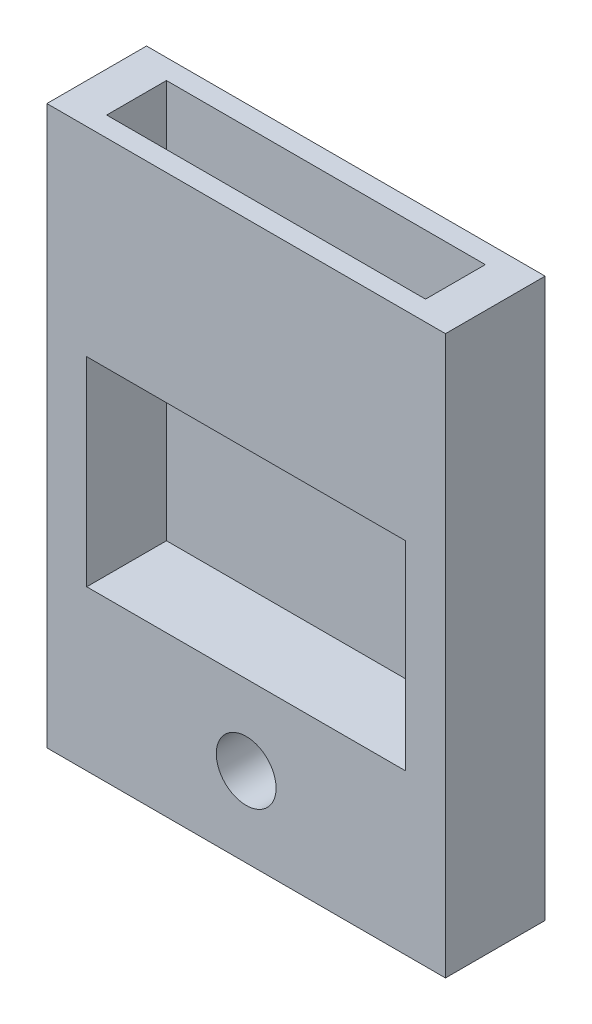
ISO-10303-21;
HEADER;
FILE_DESCRIPTION(('STEP AP214'),'2;1');
FILE_NAME('part.step','',(''),(''),'','','');
FILE_SCHEMA(('AUTOMOTIVE_DESIGN { 1 0 10303 214 1 1 1 1 }'));
ENDSEC;
DATA;
#1=APPLICATION_CONTEXT('core data for automotive mechanical design processes');
#2=APPLICATION_PROTOCOL_DEFINITION('international standard','automotive_design',2000,#1);
#3=PRODUCT_CONTEXT('',#1,'mechanical');
#4=PRODUCT('Part','Part','',(#3));
#5=PRODUCT_RELATED_PRODUCT_CATEGORY('part','',(#4));
#6=PRODUCT_DEFINITION_FORMATION('','',#4);
#7=PRODUCT_DEFINITION_CONTEXT('part definition',#1,'design');
#8=PRODUCT_DEFINITION('design','',#6,#7);
#9=PRODUCT_DEFINITION_SHAPE('','',#8);
#10=(LENGTH_UNIT() NAMED_UNIT(*) SI_UNIT(.MILLI.,.METRE.));
#11=(NAMED_UNIT(*) PLANE_ANGLE_UNIT() SI_UNIT($,.RADIAN.));
#12=(NAMED_UNIT(*) SI_UNIT($,.STERADIAN.) SOLID_ANGLE_UNIT());
#13=UNCERTAINTY_MEASURE_WITH_UNIT(LENGTH_MEASURE(1.E-05),#10,'distance_accuracy_value','');
#14=(GEOMETRIC_REPRESENTATION_CONTEXT(3) GLOBAL_UNCERTAINTY_ASSIGNED_CONTEXT((#13)) GLOBAL_UNIT_ASSIGNED_CONTEXT((#10,
#11,#12)) REPRESENTATION_CONTEXT('',''));
#15=CARTESIAN_POINT('',(0.,0.,0.));
#16=DIRECTION('',(0.,0.,1.));
#17=DIRECTION('',(1.,0.,0.));
#18=AXIS2_PLACEMENT_3D('',#15,#16,#17);
#19=CARTESIAN_POINT('',(0.,0.,5.));
#20=DIRECTION('',(1.,0.,0.));
#21=DIRECTION('',(0.,0.,-1.));
#22=AXIS2_PLACEMENT_3D('',#19,#20,#21);
#23=PLANE('',#22);
#24=DIRECTION('',(0.,-1.,0.));
#25=VECTOR('',#24,1.);
#26=CARTESIAN_POINT('',(0.,0.,0.));
#27=LINE('',#26,#25);
#28=CARTESIAN_POINT('',(0.,28.,0.));
#29=VERTEX_POINT('',#28);
#30=CARTESIAN_POINT('',(0.,0.,0.));
#31=VERTEX_POINT('',#30);
#32=EDGE_CURVE('E165',#29,#31,#27,.T.);
#33=ORIENTED_EDGE('',*,*,#32,.T.);
#34=DIRECTION('',(0.,0.,-1.));
#35=VECTOR('',#34,1.);
#36=CARTESIAN_POINT('',(0.,0.,5.));
#37=LINE('',#36,#35);
#38=CARTESIAN_POINT('',(0.,0.,5.));
#39=VERTEX_POINT('',#38);
#40=EDGE_CURVE('E11',#39,#31,#37,.T.);
#41=ORIENTED_EDGE('',*,*,#40,.F.);
#42=DIRECTION('',(0.,-1.,0.));
#43=VECTOR('',#42,1.);
#44=CARTESIAN_POINT('',(0.,0.,5.));
#45=LINE('',#44,#43);
#46=CARTESIAN_POINT('',(0.,28.,5.));
#47=VERTEX_POINT('',#46);
#48=EDGE_CURVE('E168',#47,#39,#45,.T.);
#49=ORIENTED_EDGE('',*,*,#48,.F.);
#50=DIRECTION('',(0.,0.,-1.));
#51=VECTOR('',#50,1.);
#52=CARTESIAN_POINT('',(0.,28.,5.));
#53=LINE('',#52,#51);
#54=EDGE_CURVE('E178',#47,#29,#53,.T.);
#55=ORIENTED_EDGE('',*,*,#54,.T.);
#56=EDGE_LOOP('',(#33,#41,#49,#55));
#57=FACE_BOUND('',#56,.T.);
#58=ADVANCED_FACE('F33',(#57),#23,.F.);
#59=CARTESIAN_POINT('',(0.,0.,5.));
#60=DIRECTION('',(0.,1.,0.));
#61=DIRECTION('',(0.,0.,1.));
#62=AXIS2_PLACEMENT_3D('',#59,#60,#61);
#63=PLANE('',#62);
#64=DIRECTION('',(1.,0.,0.));
#65=VECTOR('',#64,1.);
#66=CARTESIAN_POINT('',(0.,0.,0.));
#67=LINE('',#66,#65);
#68=CARTESIAN_POINT('',(20.,0.,0.));
#69=VERTEX_POINT('',#68);
#70=EDGE_CURVE('E181',#31,#69,#67,.T.);
#71=ORIENTED_EDGE('',*,*,#70,.T.);
#72=DIRECTION('',(0.,0.,-1.));
#73=VECTOR('',#72,1.);
#74=CARTESIAN_POINT('',(20.,0.,5.));
#75=LINE('',#74,#73);
#76=CARTESIAN_POINT('',(20.,0.,5.));
#77=VERTEX_POINT('',#76);
#78=EDGE_CURVE('E40',#77,#69,#75,.T.);
#79=ORIENTED_EDGE('',*,*,#78,.F.);
#80=DIRECTION('',(1.,0.,0.));
#81=VECTOR('',#80,1.);
#82=CARTESIAN_POINT('',(0.,0.,5.));
#83=LINE('',#82,#81);
#84=EDGE_CURVE('E171',#39,#77,#83,.T.);
#85=ORIENTED_EDGE('',*,*,#84,.F.);
#86=ORIENTED_EDGE('',*,*,#40,.T.);
#87=EDGE_LOOP('',(#71,#79,#85,#86));
#88=FACE_BOUND('',#87,.T.);
#89=ADVANCED_FACE('F210',(#88),#63,.F.);
#90=CARTESIAN_POINT('',(20.,0.,5.));
#91=DIRECTION('',(-1.,0.,0.));
#92=DIRECTION('',(0.,0.,1.));
#93=AXIS2_PLACEMENT_3D('',#90,#91,#92);
#94=PLANE('',#93);
#95=DIRECTION('',(0.,1.,0.));
#96=VECTOR('',#95,1.);
#97=CARTESIAN_POINT('',(20.,0.,0.));
#98=LINE('',#97,#96);
#99=CARTESIAN_POINT('',(20.,28.,0.));
#100=VERTEX_POINT('',#99);
#101=EDGE_CURVE('E183',#69,#100,#98,.T.);
#102=ORIENTED_EDGE('',*,*,#101,.T.);
#103=DIRECTION('',(0.,0.,-1.));
#104=VECTOR('',#103,1.);
#105=CARTESIAN_POINT('',(20.,28.,5.));
#106=LINE('',#105,#104);
#107=CARTESIAN_POINT('',(20.,28.,5.));
#108=VERTEX_POINT('',#107);
#109=EDGE_CURVE('E188',#108,#100,#106,.T.);
#110=ORIENTED_EDGE('',*,*,#109,.F.);
#111=DIRECTION('',(0.,1.,0.));
#112=VECTOR('',#111,1.);
#113=CARTESIAN_POINT('',(20.,0.,5.));
#114=LINE('',#113,#112);
#115=EDGE_CURVE('E174',#77,#108,#114,.T.);
#116=ORIENTED_EDGE('',*,*,#115,.F.);
#117=ORIENTED_EDGE('',*,*,#78,.T.);
#118=EDGE_LOOP('',(#102,#110,#116,#117));
#119=FACE_BOUND('',#118,.T.);
#120=ADVANCED_FACE('F195',(#119),#94,.F.);
#121=CARTESIAN_POINT('',(0.,28.,5.));
#122=DIRECTION('',(0.,-1.,0.));
#123=DIRECTION('',(0.,0.,-1.));
#124=AXIS2_PLACEMENT_3D('',#121,#122,#123);
#125=PLANE('',#124);
#126=DIRECTION('',(-1.,0.,0.));
#127=VECTOR('',#126,1.);
#128=CARTESIAN_POINT('',(2.,28.,0.999999999999997));
#129=LINE('',#128,#127);
#130=CARTESIAN_POINT('',(18.,28.,0.999999999999997));
#131=VERTEX_POINT('',#130);
#132=CARTESIAN_POINT('',(2.,28.,0.999999999999997));
#133=VERTEX_POINT('',#132);
#134=EDGE_CURVE('E147',#131,#133,#129,.T.);
#135=ORIENTED_EDGE('',*,*,#134,.F.);
#136=DIRECTION('',(0.,0.,-1.));
#137=VECTOR('',#136,1.);
#138=CARTESIAN_POINT('',(18.,28.,4.));
#139=LINE('',#138,#137);
#140=CARTESIAN_POINT('',(18.,28.,4.));
#141=VERTEX_POINT('',#140);
#142=EDGE_CURVE('E142',#141,#131,#139,.T.);
#143=ORIENTED_EDGE('',*,*,#142,.F.);
#144=DIRECTION('',(1.,0.,0.));
#145=VECTOR('',#144,1.);
#146=CARTESIAN_POINT('',(2.,28.,4.));
#147=LINE('',#146,#145);
#148=CARTESIAN_POINT('',(2.,28.,4.));
#149=VERTEX_POINT('',#148);
#150=EDGE_CURVE('E119',#149,#141,#147,.T.);
#151=ORIENTED_EDGE('',*,*,#150,.F.);
#152=DIRECTION('',(0.,0.,1.));
#153=VECTOR('',#152,1.);
#154=CARTESIAN_POINT('',(2.,28.,4.));
#155=LINE('',#154,#153);
#156=EDGE_CURVE('E149',#133,#149,#155,.T.);
#157=ORIENTED_EDGE('',*,*,#156,.F.);
#158=EDGE_LOOP('',(#135,#143,#151,#157));
#159=FACE_BOUND('',#158,.T.);
#160=DIRECTION('',(-1.,0.,0.));
#161=VECTOR('',#160,1.);
#162=CARTESIAN_POINT('',(0.,28.,0.));
#163=LINE('',#162,#161);
#164=EDGE_CURVE('E172',#100,#29,#163,.T.);
#165=ORIENTED_EDGE('',*,*,#164,.T.);
#166=ORIENTED_EDGE('',*,*,#54,.F.);
#167=DIRECTION('',(-1.,0.,0.));
#168=VECTOR('',#167,1.);
#169=CARTESIAN_POINT('',(0.,28.,5.));
#170=LINE('',#169,#168);
#171=EDGE_CURVE('E176',#108,#47,#170,.T.);
#172=ORIENTED_EDGE('',*,*,#171,.F.);
#173=ORIENTED_EDGE('',*,*,#109,.T.);
#174=EDGE_LOOP('',(#165,#166,#172,#173));
#175=FACE_BOUND('',#174,.T.);
#176=ADVANCED_FACE('F204',(#159,#175),#125,.F.);
#177=CARTESIAN_POINT('',(0.,0.,5.));
#178=DIRECTION('',(0.,0.,-1.));
#179=DIRECTION('',(-1.,0.,0.));
#180=AXIS2_PLACEMENT_3D('',#177,#178,#179);
#181=PLANE('',#180);
#182=DIRECTION('',(1.,0.,0.));
#183=VECTOR('',#182,1.);
#184=CARTESIAN_POINT('',(2.,8.,5.));
#185=LINE('',#184,#183);
#186=CARTESIAN_POINT('',(2.,8.,5.));
#187=VERTEX_POINT('',#186);
#188=CARTESIAN_POINT('',(18.,8.,5.));
#189=VERTEX_POINT('',#188);
#190=EDGE_CURVE('E122',#187,#189,#185,.T.);
#191=ORIENTED_EDGE('',*,*,#190,.F.);
#192=DIRECTION('',(0.,-1.,0.));
#193=VECTOR('',#192,1.);
#194=CARTESIAN_POINT('',(2.,18.,5.));
#195=LINE('',#194,#193);
#196=CARTESIAN_POINT('',(2.,18.,5.));
#197=VERTEX_POINT('',#196);
#198=EDGE_CURVE('E126',#197,#187,#195,.T.);
#199=ORIENTED_EDGE('',*,*,#198,.F.);
#200=DIRECTION('',(-1.,0.,0.));
#201=VECTOR('',#200,1.);
#202=CARTESIAN_POINT('',(2.,18.,5.));
#203=LINE('',#202,#201);
#204=CARTESIAN_POINT('',(18.,18.,5.));
#205=VERTEX_POINT('',#204);
#206=EDGE_CURVE('E131',#205,#197,#203,.T.);
#207=ORIENTED_EDGE('',*,*,#206,.F.);
#208=DIRECTION('',(0.,1.,0.));
#209=VECTOR('',#208,1.);
#210=CARTESIAN_POINT('',(18.,18.,5.));
#211=LINE('',#210,#209);
#212=EDGE_CURVE('E116',#189,#205,#211,.T.);
#213=ORIENTED_EDGE('',*,*,#212,.F.);
#214=EDGE_LOOP('',(#191,#199,#207,#213));
#215=FACE_BOUND('',#214,.T.);
#216=CARTESIAN_POINT('',(10.,4.,5.));
#217=DIRECTION('',(0.,0.,1.));
#218=DIRECTION('',(1.,0.,0.));
#219=AXIS2_PLACEMENT_3D('',#216,#217,#218);
#220=CIRCLE('',#219,1.5);
#221=CARTESIAN_POINT('',(11.5,4.,5.));
#222=VERTEX_POINT('',#221);
#223=EDGE_CURVE('E156',#222,#222,#220,.T.);
#224=ORIENTED_EDGE('',*,*,#223,.F.);
#225=EDGE_LOOP('',(#224));
#226=FACE_BOUND('',#225,.T.);
#227=ORIENTED_EDGE('',*,*,#48,.T.);
#228=ORIENTED_EDGE('',*,*,#84,.T.);
#229=ORIENTED_EDGE('',*,*,#115,.T.);
#230=ORIENTED_EDGE('',*,*,#171,.T.);
#231=EDGE_LOOP('',(#227,#228,#229,#230));
#232=FACE_BOUND('',#231,.T.);
#233=ADVANCED_FACE('F128',(#215,#226,#232),#181,.F.);
#234=CARTESIAN_POINT('',(0.,0.,0.));
#235=DIRECTION('',(0.,0.,-1.));
#236=DIRECTION('',(-1.,0.,0.));
#237=AXIS2_PLACEMENT_3D('',#234,#235,#236);
#238=PLANE('',#237);
#239=CARTESIAN_POINT('',(10.,4.,0.));
#240=DIRECTION('',(0.,0.,1.));
#241=DIRECTION('',(1.,0.,0.));
#242=AXIS2_PLACEMENT_3D('',#239,#240,#241);
#243=CIRCLE('',#242,1.5);
#244=CARTESIAN_POINT('',(11.5,4.,0.));
#245=VERTEX_POINT('',#244);
#246=EDGE_CURVE('E162',#245,#245,#243,.T.);
#247=ORIENTED_EDGE('',*,*,#246,.T.);
#248=EDGE_LOOP('',(#247));
#249=FACE_BOUND('',#248,.T.);
#250=ORIENTED_EDGE('',*,*,#32,.F.);
#251=ORIENTED_EDGE('',*,*,#164,.F.);
#252=ORIENTED_EDGE('',*,*,#101,.F.);
#253=ORIENTED_EDGE('',*,*,#70,.F.);
#254=EDGE_LOOP('',(#250,#251,#252,#253));
#255=FACE_BOUND('',#254,.T.);
#256=ADVANCED_FACE('F201',(#249,#255),#238,.T.);
#257=CARTESIAN_POINT('',(10.,4.,0.));
#258=DIRECTION('',(0.,0.,1.));
#259=DIRECTION('',(1.,0.,0.));
#260=AXIS2_PLACEMENT_3D('',#257,#258,#259);
#261=CYLINDRICAL_SURFACE('',#260,1.5);
#262=ORIENTED_EDGE('',*,*,#246,.F.);
#263=EDGE_LOOP('',(#262));
#264=FACE_BOUND('',#263,.T.);
#265=ORIENTED_EDGE('',*,*,#223,.T.);
#266=EDGE_LOOP('',(#265));
#267=FACE_BOUND('',#266,.T.);
#268=ADVANCED_FACE('F223',(#264,#267),#261,.F.);
#269=CARTESIAN_POINT('',(18.,8.,4.));
#270=DIRECTION('',(1.,0.,0.));
#271=DIRECTION('',(0.,0.,-1.));
#272=AXIS2_PLACEMENT_3D('',#269,#270,#271);
#273=PLANE('',#272);
#274=ORIENTED_EDGE('',*,*,#142,.T.);
#275=DIRECTION('',(0.,1.,0.));
#276=VECTOR('',#275,1.);
#277=CARTESIAN_POINT('',(18.,8.,0.999999999999997));
#278=LINE('',#277,#276);
#279=CARTESIAN_POINT('',(18.,8.,0.999999999999997));
#280=VERTEX_POINT('',#279);
#281=EDGE_CURVE('E55',#280,#131,#278,.T.);
#282=ORIENTED_EDGE('',*,*,#281,.F.);
#283=DIRECTION('',(0.,0.,-1.));
#284=VECTOR('',#283,1.);
#285=CARTESIAN_POINT('',(18.,8.,4.));
#286=LINE('',#285,#284);
#287=EDGE_CURVE('E112',#189,#280,#286,.T.);
#288=ORIENTED_EDGE('',*,*,#287,.F.);
#289=ORIENTED_EDGE('',*,*,#212,.T.);
#290=DIRECTION('',(0.,0.,1.));
#291=VECTOR('',#290,1.);
#292=CARTESIAN_POINT('',(18.,18.,1.));
#293=LINE('',#292,#291);
#294=CARTESIAN_POINT('',(18.,18.,4.));
#295=VERTEX_POINT('',#294);
#296=EDGE_CURVE('E133',#295,#205,#293,.T.);
#297=ORIENTED_EDGE('',*,*,#296,.F.);
#298=DIRECTION('',(0.,1.,0.));
#299=VECTOR('',#298,1.);
#300=CARTESIAN_POINT('',(18.,8.,4.));
#301=LINE('',#300,#299);
#302=EDGE_CURVE('E154',#295,#141,#301,.T.);
#303=ORIENTED_EDGE('',*,*,#302,.T.);
#304=EDGE_LOOP('',(#274,#282,#288,#289,#297,#303));
#305=FACE_BOUND('',#304,.T.);
#306=ADVANCED_FACE('F113',(#305),#273,.F.);
#307=CARTESIAN_POINT('',(2.,8.,4.));
#308=DIRECTION('',(0.,0.,1.));
#309=DIRECTION('',(1.,0.,0.));
#310=AXIS2_PLACEMENT_3D('',#307,#308,#309);
#311=PLANE('',#310);
#312=ORIENTED_EDGE('',*,*,#302,.F.);
#313=DIRECTION('',(-1.,0.,0.));
#314=VECTOR('',#313,1.);
#315=CARTESIAN_POINT('',(2.,18.,4.));
#316=LINE('',#315,#314);
#317=CARTESIAN_POINT('',(2.,18.,4.));
#318=VERTEX_POINT('',#317);
#319=EDGE_CURVE('E139',#295,#318,#316,.T.);
#320=ORIENTED_EDGE('',*,*,#319,.T.);
#321=DIRECTION('',(0.,1.,0.));
#322=VECTOR('',#321,1.);
#323=CARTESIAN_POINT('',(2.,8.,4.));
#324=LINE('',#323,#322);
#325=EDGE_CURVE('E157',#318,#149,#324,.T.);
#326=ORIENTED_EDGE('',*,*,#325,.T.);
#327=ORIENTED_EDGE('',*,*,#150,.T.);
#328=EDGE_LOOP('',(#312,#320,#326,#327));
#329=FACE_BOUND('',#328,.T.);
#330=ADVANCED_FACE('F232',(#329),#311,.F.);
#331=CARTESIAN_POINT('',(2.,8.,4.));
#332=DIRECTION('',(-1.,0.,0.));
#333=DIRECTION('',(0.,0.,1.));
#334=AXIS2_PLACEMENT_3D('',#331,#332,#333);
#335=PLANE('',#334);
#336=ORIENTED_EDGE('',*,*,#325,.F.);
#337=DIRECTION('',(0.,0.,1.));
#338=VECTOR('',#337,1.);
#339=CARTESIAN_POINT('',(2.,18.,1.));
#340=LINE('',#339,#338);
#341=EDGE_CURVE('E137',#318,#197,#340,.T.);
#342=ORIENTED_EDGE('',*,*,#341,.T.);
#343=ORIENTED_EDGE('',*,*,#198,.T.);
#344=DIRECTION('',(0.,0.,1.));
#345=VECTOR('',#344,1.);
#346=CARTESIAN_POINT('',(2.,8.,4.));
#347=LINE('',#346,#345);
#348=CARTESIAN_POINT('',(2.,8.,0.999999999999997));
#349=VERTEX_POINT('',#348);
#350=EDGE_CURVE('E47',#349,#187,#347,.T.);
#351=ORIENTED_EDGE('',*,*,#350,.F.);
#352=DIRECTION('',(0.,1.,0.));
#353=VECTOR('',#352,1.);
#354=CARTESIAN_POINT('',(2.,8.,0.999999999999997));
#355=LINE('',#354,#353);
#356=EDGE_CURVE('E159',#349,#133,#355,.T.);
#357=ORIENTED_EDGE('',*,*,#356,.T.);
#358=ORIENTED_EDGE('',*,*,#156,.T.);
#359=EDGE_LOOP('',(#336,#342,#343,#351,#357,#358));
#360=FACE_BOUND('',#359,.T.);
#361=ADVANCED_FACE('F236',(#360),#335,.F.);
#362=CARTESIAN_POINT('',(2.,8.,0.999999999999997));
#363=DIRECTION('',(0.,0.,-1.));
#364=DIRECTION('',(-1.,0.,0.));
#365=AXIS2_PLACEMENT_3D('',#362,#363,#364);
#366=PLANE('',#365);
#367=ORIENTED_EDGE('',*,*,#134,.T.);
#368=ORIENTED_EDGE('',*,*,#356,.F.);
#369=DIRECTION('',(-1.,0.,0.));
#370=VECTOR('',#369,1.);
#371=CARTESIAN_POINT('',(2.,8.,0.999999999999997));
#372=LINE('',#371,#370);
#373=EDGE_CURVE('E118',#280,#349,#372,.T.);
#374=ORIENTED_EDGE('',*,*,#373,.F.);
#375=ORIENTED_EDGE('',*,*,#281,.T.);
#376=EDGE_LOOP('',(#367,#368,#374,#375));
#377=FACE_BOUND('',#376,.T.);
#378=ADVANCED_FACE('F233',(#377),#366,.F.);
#379=CARTESIAN_POINT('',(0.,8.,0.));
#380=DIRECTION('',(0.,-1.,0.));
#381=DIRECTION('',(0.,0.,-1.));
#382=AXIS2_PLACEMENT_3D('',#379,#380,#381);
#383=PLANE('',#382);
#384=ORIENTED_EDGE('',*,*,#287,.T.);
#385=ORIENTED_EDGE('',*,*,#373,.T.);
#386=ORIENTED_EDGE('',*,*,#350,.T.);
#387=ORIENTED_EDGE('',*,*,#190,.T.);
#388=EDGE_LOOP('',(#384,#385,#386,#387));
#389=FACE_BOUND('',#388,.T.);
#390=ADVANCED_FACE('F123',(#389),#383,.F.);
#391=CARTESIAN_POINT('',(2.,18.,1.));
#392=DIRECTION('',(0.,1.,0.));
#393=DIRECTION('',(0.,0.,1.));
#394=AXIS2_PLACEMENT_3D('',#391,#392,#393);
#395=PLANE('',#394);
#396=ORIENTED_EDGE('',*,*,#296,.T.);
#397=ORIENTED_EDGE('',*,*,#206,.T.);
#398=ORIENTED_EDGE('',*,*,#341,.F.);
#399=ORIENTED_EDGE('',*,*,#319,.F.);
#400=EDGE_LOOP('',(#396,#397,#398,#399));
#401=FACE_BOUND('',#400,.T.);
#402=ADVANCED_FACE('F245',(#401),#395,.F.);
#403=CLOSED_SHELL('',(#58,#89,#120,#176,#233,#256,#268,#306,#330,#361,#378,#390,#402));
#404=MANIFOLD_SOLID_BREP('B2',#403);
#405=ADVANCED_BREP_SHAPE_REPRESENTATION('',(#18,#404),#14);
#406=SHAPE_DEFINITION_REPRESENTATION(#9,#405);
ENDSEC;
END-ISO-10303-21;
